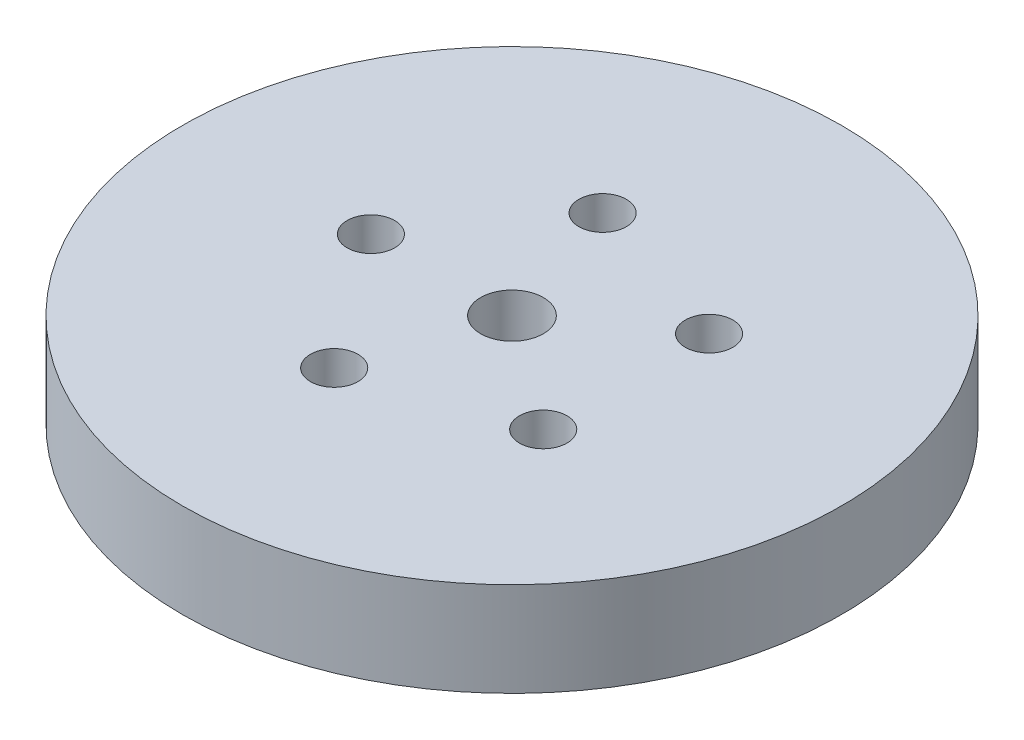
ISO-10303-21;
HEADER;
FILE_DESCRIPTION(('STEP AP214'),'2;1');
FILE_NAME('part.step','',(''),(''),'','','');
FILE_SCHEMA(('AUTOMOTIVE_DESIGN { 1 0 10303 214 1 1 1 1 }'));
ENDSEC;
DATA;
#1=APPLICATION_CONTEXT('core data for automotive mechanical design processes');
#2=APPLICATION_PROTOCOL_DEFINITION('international standard','automotive_design',2000,#1);
#3=PRODUCT_CONTEXT('',#1,'mechanical');
#4=PRODUCT('Part','Part','',(#3));
#5=PRODUCT_RELATED_PRODUCT_CATEGORY('part','',(#4));
#6=PRODUCT_DEFINITION_FORMATION('','',#4);
#7=PRODUCT_DEFINITION_CONTEXT('part definition',#1,'design');
#8=PRODUCT_DEFINITION('design','',#6,#7);
#9=PRODUCT_DEFINITION_SHAPE('','',#8);
#10=(LENGTH_UNIT() NAMED_UNIT(*) SI_UNIT(.MILLI.,.METRE.));
#11=(NAMED_UNIT(*) PLANE_ANGLE_UNIT() SI_UNIT($,.RADIAN.));
#12=(NAMED_UNIT(*) SI_UNIT($,.STERADIAN.) SOLID_ANGLE_UNIT());
#13=UNCERTAINTY_MEASURE_WITH_UNIT(LENGTH_MEASURE(1.E-05),#10,'distance_accuracy_value','');
#14=(GEOMETRIC_REPRESENTATION_CONTEXT(3) GLOBAL_UNCERTAINTY_ASSIGNED_CONTEXT((#13)) GLOBAL_UNIT_ASSIGNED_CONTEXT((#10,
#11,#12)) REPRESENTATION_CONTEXT('',''));
#15=CARTESIAN_POINT('',(0.,0.,0.));
#16=DIRECTION('',(0.,0.,1.));
#17=DIRECTION('',(1.,0.,0.));
#18=AXIS2_PLACEMENT_3D('',#15,#16,#17);
#19=CARTESIAN_POINT('',(0.,15.,0.));
#20=DIRECTION('',(0.,-1.,0.));
#21=DIRECTION('',(0.,0.,-1.));
#22=AXIS2_PLACEMENT_3D('',#19,#20,#21);
#23=CYLINDRICAL_SURFACE('',#22,52.5);
#24=CARTESIAN_POINT('',(0.,15.,0.));
#25=DIRECTION('',(0.,1.,0.));
#26=DIRECTION('',(0.,0.,1.));
#27=AXIS2_PLACEMENT_3D('',#24,#25,#26);
#28=CIRCLE('',#27,52.5);
#29=CARTESIAN_POINT('',(0.,15.,52.5));
#30=VERTEX_POINT('',#29);
#31=EDGE_CURVE('E10',#30,#30,#28,.T.);
#32=ORIENTED_EDGE('',*,*,#31,.F.);
#33=EDGE_LOOP('',(#32));
#34=FACE_BOUND('',#33,.T.);
#35=CARTESIAN_POINT('',(0.,0.,0.));
#36=DIRECTION('',(0.,1.,0.));
#37=DIRECTION('',(0.,0.,1.));
#38=AXIS2_PLACEMENT_3D('',#35,#36,#37);
#39=CIRCLE('',#38,52.5);
#40=CARTESIAN_POINT('',(0.,0.,52.5));
#41=VERTEX_POINT('',#40);
#42=EDGE_CURVE('E37',#41,#41,#39,.T.);
#43=ORIENTED_EDGE('',*,*,#42,.T.);
#44=EDGE_LOOP('',(#43));
#45=FACE_BOUND('',#44,.T.);
#46=ADVANCED_FACE('F40',(#34,#45),#23,.T.);
#47=CARTESIAN_POINT('',(0.,15.,0.));
#48=DIRECTION('',(0.,1.,0.));
#49=DIRECTION('',(0.,0.,1.));
#50=AXIS2_PLACEMENT_3D('',#47,#48,#49);
#51=PLANE('',#50);
#52=CARTESIAN_POINT('',(-6.94594162949821,15.,21.3774102032871));
#53=DIRECTION('',(0.,1.,0.));
#54=DIRECTION('',(0.951056516295155,0.,0.309016994374945));
#55=AXIS2_PLACEMENT_3D('',#52,#53,#54);
#56=CIRCLE('',#55,3.7830863279813);
#57=CARTESIAN_POINT('',(-3.34801272556448,15.,22.5464481698208));
#58=VERTEX_POINT('',#57);
#59=EDGE_CURVE('E78',#58,#58,#56,.T.);
#60=ORIENTED_EDGE('',*,*,#59,.F.);
#61=EDGE_LOOP('',(#60));
#62=FACE_BOUND('',#61,.T.);
#63=CARTESIAN_POINT('',(18.1847112698994,15.,13.2119660970801));
#64=DIRECTION('',(0.,1.,0.));
#65=DIRECTION('',(0.587785252292469,0.,-0.809016994374951));
#66=AXIS2_PLACEMENT_3D('',#63,#64,#65);
#67=CIRCLE('',#66,3.7830863279813);
#68=CARTESIAN_POINT('',(20.4083536216361,15.,10.1513849665557));
#69=VERTEX_POINT('',#68);
#70=EDGE_CURVE('E71',#69,#69,#67,.T.);
#71=ORIENTED_EDGE('',*,*,#70,.F.);
#72=EDGE_LOOP('',(#71));
#73=FACE_BOUND('',#72,.T.);
#74=CARTESIAN_POINT('',(18.1847112698992,15.,-13.2119660970804));
#75=DIRECTION('',(0.,1.,0.));
#76=DIRECTION('',(-0.58778525229248,0.,-0.809016994374942));
#77=AXIS2_PLACEMENT_3D('',#74,#75,#76);
#78=CIRCLE('',#77,3.7830863279813);
#79=CARTESIAN_POINT('',(15.9610689181625,15.,-16.2725472276047));
#80=VERTEX_POINT('',#79);
#81=EDGE_CURVE('E70',#80,#80,#78,.T.);
#82=ORIENTED_EDGE('',*,*,#81,.F.);
#83=EDGE_LOOP('',(#82));
#84=FACE_BOUND('',#83,.T.);
#85=CARTESIAN_POINT('',(-6.94594162949851,15.,-21.377410203287));
#86=DIRECTION('',(0.,1.,0.));
#87=DIRECTION('',(-0.95105651629515,0.,0.309016994374958));
#88=AXIS2_PLACEMENT_3D('',#85,#86,#87);
#89=CIRCLE('',#88,3.7830863279813);
#90=CARTESIAN_POINT('',(-10.5438705334322,15.,-20.2083722367532));
#91=VERTEX_POINT('',#90);
#92=EDGE_CURVE('E61',#91,#91,#89,.T.);
#93=ORIENTED_EDGE('',*,*,#92,.F.);
#94=EDGE_LOOP('',(#93));
#95=FACE_BOUND('',#94,.T.);
#96=CARTESIAN_POINT('',(-22.4775392808021,15.,0.));
#97=DIRECTION('',(0.,1.,0.));
#98=DIRECTION('',(0.,0.,1.));
#99=AXIS2_PLACEMENT_3D('',#96,#97,#98);
#100=CIRCLE('',#99,3.7830863279813);
#101=CARTESIAN_POINT('',(-22.4775392808021,15.,3.7830863279813));
#102=VERTEX_POINT('',#101);
#103=EDGE_CURVE('E54',#102,#102,#100,.T.);
#104=ORIENTED_EDGE('',*,*,#103,.F.);
#105=EDGE_LOOP('',(#104));
#106=FACE_BOUND('',#105,.T.);
#107=CARTESIAN_POINT('',(0.,15.,0.));
#108=DIRECTION('',(0.,1.,0.));
#109=DIRECTION('',(0.,0.,1.));
#110=AXIS2_PLACEMENT_3D('',#107,#108,#109);
#111=CIRCLE('',#110,5.);
#112=CARTESIAN_POINT('',(0.,15.,5.));
#113=VERTEX_POINT('',#112);
#114=EDGE_CURVE('E50',#113,#113,#111,.T.);
#115=ORIENTED_EDGE('',*,*,#114,.F.);
#116=EDGE_LOOP('',(#115));
#117=FACE_BOUND('',#116,.T.);
#118=ORIENTED_EDGE('',*,*,#31,.T.);
#119=EDGE_LOOP('',(#118));
#120=FACE_BOUND('',#119,.T.);
#121=ADVANCED_FACE('F94',(#62,#73,#84,#95,#106,#117,#120),#51,.T.);
#122=CARTESIAN_POINT('',(0.,0.,0.));
#123=DIRECTION('',(0.,1.,0.));
#124=DIRECTION('',(0.,0.,1.));
#125=AXIS2_PLACEMENT_3D('',#122,#123,#124);
#126=PLANE('',#125);
#127=CARTESIAN_POINT('',(0.,0.,0.));
#128=DIRECTION('',(0.,1.,0.));
#129=DIRECTION('',(0.,0.,1.));
#130=AXIS2_PLACEMENT_3D('',#127,#128,#129);
#131=CIRCLE('',#130,5.);
#132=CARTESIAN_POINT('',(0.,0.,5.));
#133=VERTEX_POINT('',#132);
#134=EDGE_CURVE('E47',#133,#133,#131,.T.);
#135=ORIENTED_EDGE('',*,*,#134,.T.);
#136=EDGE_LOOP('',(#135));
#137=FACE_BOUND('',#136,.T.);
#138=ORIENTED_EDGE('',*,*,#42,.F.);
#139=EDGE_LOOP('',(#138));
#140=FACE_BOUND('',#139,.T.);
#141=ADVANCED_FACE('F100',(#137,#140),#126,.F.);
#142=CARTESIAN_POINT('',(0.,15.,0.));
#143=DIRECTION('',(0.,-1.,0.));
#144=DIRECTION('',(0.,0.,-1.));
#145=AXIS2_PLACEMENT_3D('',#142,#143,#144);
#146=CYLINDRICAL_SURFACE('',#145,5.);
#147=ORIENTED_EDGE('',*,*,#114,.T.);
#148=EDGE_LOOP('',(#147));
#149=FACE_BOUND('',#148,.T.);
#150=ORIENTED_EDGE('',*,*,#134,.F.);
#151=EDGE_LOOP('',(#150));
#152=FACE_BOUND('',#151,.T.);
#153=ADVANCED_FACE('F108',(#149,#152),#146,.F.);
#154=CARTESIAN_POINT('',(-22.4775392808021,2.51620610059945,0.));
#155=DIRECTION('',(0.,1.,0.));
#156=DIRECTION('',(0.,0.,1.));
#157=AXIS2_PLACEMENT_3D('',#154,#155,#156);
#158=CYLINDRICAL_SURFACE('',#157,3.7830863279813);
#159=CARTESIAN_POINT('',(-22.4775392808021,2.51620610059945,0.));
#160=DIRECTION('',(0.,1.,0.));
#161=DIRECTION('',(0.,0.,1.));
#162=AXIS2_PLACEMENT_3D('',#159,#160,#161);
#163=CIRCLE('',#162,3.7830863279813);
#164=CARTESIAN_POINT('',(-22.4775392808021,2.51620610059945,3.7830863279813));
#165=VERTEX_POINT('',#164);
#166=EDGE_CURVE('E55',#165,#165,#163,.T.);
#167=ORIENTED_EDGE('',*,*,#166,.F.);
#168=EDGE_LOOP('',(#167));
#169=FACE_BOUND('',#168,.T.);
#170=ORIENTED_EDGE('',*,*,#103,.T.);
#171=EDGE_LOOP('',(#170));
#172=FACE_BOUND('',#171,.T.);
#173=ADVANCED_FACE('F115',(#169,#172),#158,.F.);
#174=CARTESIAN_POINT('',(-22.4775392808021,2.51620610059945,0.));
#175=DIRECTION('',(0.,1.,0.));
#176=DIRECTION('',(0.,0.,1.));
#177=AXIS2_PLACEMENT_3D('',#174,#175,#176);
#178=PLANE('',#177);
#179=ORIENTED_EDGE('',*,*,#166,.T.);
#180=EDGE_LOOP('',(#179));
#181=FACE_BOUND('',#180,.T.);
#182=ADVANCED_FACE('F142',(#181),#178,.T.);
#183=CARTESIAN_POINT('',(-6.94594162949851,2.51620610059945,-21.377410203287));
#184=DIRECTION('',(0.,1.,0.));
#185=DIRECTION('',(0.,0.,1.));
#186=AXIS2_PLACEMENT_3D('',#183,#184,#185);
#187=CYLINDRICAL_SURFACE('',#186,3.7830863279813);
#188=CARTESIAN_POINT('',(-6.94594162949851,2.51620610059945,-21.377410203287));
#189=DIRECTION('',(0.,1.,0.));
#190=DIRECTION('',(-0.95105651629515,0.,0.309016994374958));
#191=AXIS2_PLACEMENT_3D('',#188,#189,#190);
#192=CIRCLE('',#191,3.7830863279813);
#193=CARTESIAN_POINT('',(-10.5438705334322,2.51620610059945,-20.2083722367532));
#194=VERTEX_POINT('',#193);
#195=EDGE_CURVE('E63',#194,#194,#192,.T.);
#196=ORIENTED_EDGE('',*,*,#195,.F.);
#197=EDGE_LOOP('',(#196));
#198=FACE_BOUND('',#197,.T.);
#199=ORIENTED_EDGE('',*,*,#92,.T.);
#200=EDGE_LOOP('',(#199));
#201=FACE_BOUND('',#200,.T.);
#202=ADVANCED_FACE('F147',(#198,#201),#187,.F.);
#203=CARTESIAN_POINT('',(-6.94594162949851,2.51620610059945,-21.377410203287));
#204=DIRECTION('',(0.,1.,0.));
#205=DIRECTION('',(-0.95105651629515,0.,0.309016994374958));
#206=AXIS2_PLACEMENT_3D('',#203,#204,#205);
#207=PLANE('',#206);
#208=ORIENTED_EDGE('',*,*,#195,.T.);
#209=EDGE_LOOP('',(#208));
#210=FACE_BOUND('',#209,.T.);
#211=ADVANCED_FACE('F163',(#210),#207,.T.);
#212=CARTESIAN_POINT('',(18.1847112698992,2.51620610059945,-13.2119660970804));
#213=DIRECTION('',(0.,1.,0.));
#214=DIRECTION('',(0.,0.,1.));
#215=AXIS2_PLACEMENT_3D('',#212,#213,#214);
#216=CYLINDRICAL_SURFACE('',#215,3.7830863279813);
#217=CARTESIAN_POINT('',(18.1847112698992,2.51620610059945,-13.2119660970804));
#218=DIRECTION('',(0.,1.,0.));
#219=DIRECTION('',(-0.58778525229248,0.,-0.809016994374942));
#220=AXIS2_PLACEMENT_3D('',#217,#218,#219);
#221=CIRCLE('',#220,3.7830863279813);
#222=CARTESIAN_POINT('',(15.9610689181625,2.51620610059945,-16.2725472276047));
#223=VERTEX_POINT('',#222);
#224=EDGE_CURVE('E69',#223,#223,#221,.T.);
#225=ORIENTED_EDGE('',*,*,#224,.F.);
#226=EDGE_LOOP('',(#225));
#227=FACE_BOUND('',#226,.T.);
#228=ORIENTED_EDGE('',*,*,#81,.T.);
#229=EDGE_LOOP('',(#228));
#230=FACE_BOUND('',#229,.T.);
#231=ADVANCED_FACE('F172',(#227,#230),#216,.F.);
#232=CARTESIAN_POINT('',(18.1847112698992,2.51620610059945,-13.2119660970804));
#233=DIRECTION('',(0.,1.,0.));
#234=DIRECTION('',(-0.58778525229248,0.,-0.809016994374942));
#235=AXIS2_PLACEMENT_3D('',#232,#233,#234);
#236=PLANE('',#235);
#237=ORIENTED_EDGE('',*,*,#224,.T.);
#238=EDGE_LOOP('',(#237));
#239=FACE_BOUND('',#238,.T.);
#240=ADVANCED_FACE('F185',(#239),#236,.T.);
#241=CARTESIAN_POINT('',(18.1847112698994,2.51620610059945,13.2119660970801));
#242=DIRECTION('',(0.,1.,0.));
#243=DIRECTION('',(0.,0.,1.));
#244=AXIS2_PLACEMENT_3D('',#241,#242,#243);
#245=CYLINDRICAL_SURFACE('',#244,3.7830863279813);
#246=CARTESIAN_POINT('',(18.1847112698994,2.51620610059945,13.2119660970801));
#247=DIRECTION('',(0.,1.,0.));
#248=DIRECTION('',(0.587785252292469,0.,-0.809016994374951));
#249=AXIS2_PLACEMENT_3D('',#246,#247,#248);
#250=CIRCLE('',#249,3.7830863279813);
#251=CARTESIAN_POINT('',(20.4083536216361,2.51620610059945,10.1513849665557));
#252=VERTEX_POINT('',#251);
#253=EDGE_CURVE('E76',#252,#252,#250,.T.);
#254=ORIENTED_EDGE('',*,*,#253,.F.);
#255=EDGE_LOOP('',(#254));
#256=FACE_BOUND('',#255,.T.);
#257=ORIENTED_EDGE('',*,*,#70,.T.);
#258=EDGE_LOOP('',(#257));
#259=FACE_BOUND('',#258,.T.);
#260=ADVANCED_FACE('F191',(#256,#259),#245,.F.);
#261=CARTESIAN_POINT('',(18.1847112698994,2.51620610059945,13.2119660970801));
#262=DIRECTION('',(0.,1.,0.));
#263=DIRECTION('',(0.587785252292469,0.,-0.809016994374951));
#264=AXIS2_PLACEMENT_3D('',#261,#262,#263);
#265=PLANE('',#264);
#266=ORIENTED_EDGE('',*,*,#253,.T.);
#267=EDGE_LOOP('',(#266));
#268=FACE_BOUND('',#267,.T.);
#269=ADVANCED_FACE('F89',(#268),#265,.T.);
#270=CARTESIAN_POINT('',(-6.94594162949821,2.51620610059945,21.3774102032871));
#271=DIRECTION('',(0.,1.,0.));
#272=DIRECTION('',(0.,0.,1.));
#273=AXIS2_PLACEMENT_3D('',#270,#271,#272);
#274=CYLINDRICAL_SURFACE('',#273,3.7830863279813);
#275=CARTESIAN_POINT('',(-6.94594162949821,2.51620610059945,21.3774102032871));
#276=DIRECTION('',(0.,1.,0.));
#277=DIRECTION('',(0.951056516295155,0.,0.309016994374945));
#278=AXIS2_PLACEMENT_3D('',#275,#276,#277);
#279=CIRCLE('',#278,3.7830863279813);
#280=CARTESIAN_POINT('',(-3.34801272556448,2.51620610059945,22.5464481698208));
#281=VERTEX_POINT('',#280);
#282=EDGE_CURVE('E59',#281,#281,#279,.T.);
#283=ORIENTED_EDGE('',*,*,#282,.F.);
#284=EDGE_LOOP('',(#283));
#285=FACE_BOUND('',#284,.T.);
#286=ORIENTED_EDGE('',*,*,#59,.T.);
#287=EDGE_LOOP('',(#286));
#288=FACE_BOUND('',#287,.T.);
#289=ADVANCED_FACE('F87',(#285,#288),#274,.F.);
#290=CARTESIAN_POINT('',(-6.94594162949821,2.51620610059945,21.3774102032871));
#291=DIRECTION('',(0.,1.,0.));
#292=DIRECTION('',(0.951056516295155,0.,0.309016994374945));
#293=AXIS2_PLACEMENT_3D('',#290,#291,#292);
#294=PLANE('',#293);
#295=ORIENTED_EDGE('',*,*,#282,.T.);
#296=EDGE_LOOP('',(#295));
#297=FACE_BOUND('',#296,.T.);
#298=ADVANCED_FACE('F84',(#297),#294,.T.);
#299=CLOSED_SHELL('',(#46,#121,#141,#153,#173,#182,#202,#211,#231,#240,#260,#269,#289,#298));
#300=MANIFOLD_SOLID_BREP('B2',#299);
#301=ADVANCED_BREP_SHAPE_REPRESENTATION('',(#18,#300),#14);
#302=SHAPE_DEFINITION_REPRESENTATION(#9,#301);
ENDSEC;
END-ISO-10303-21;
